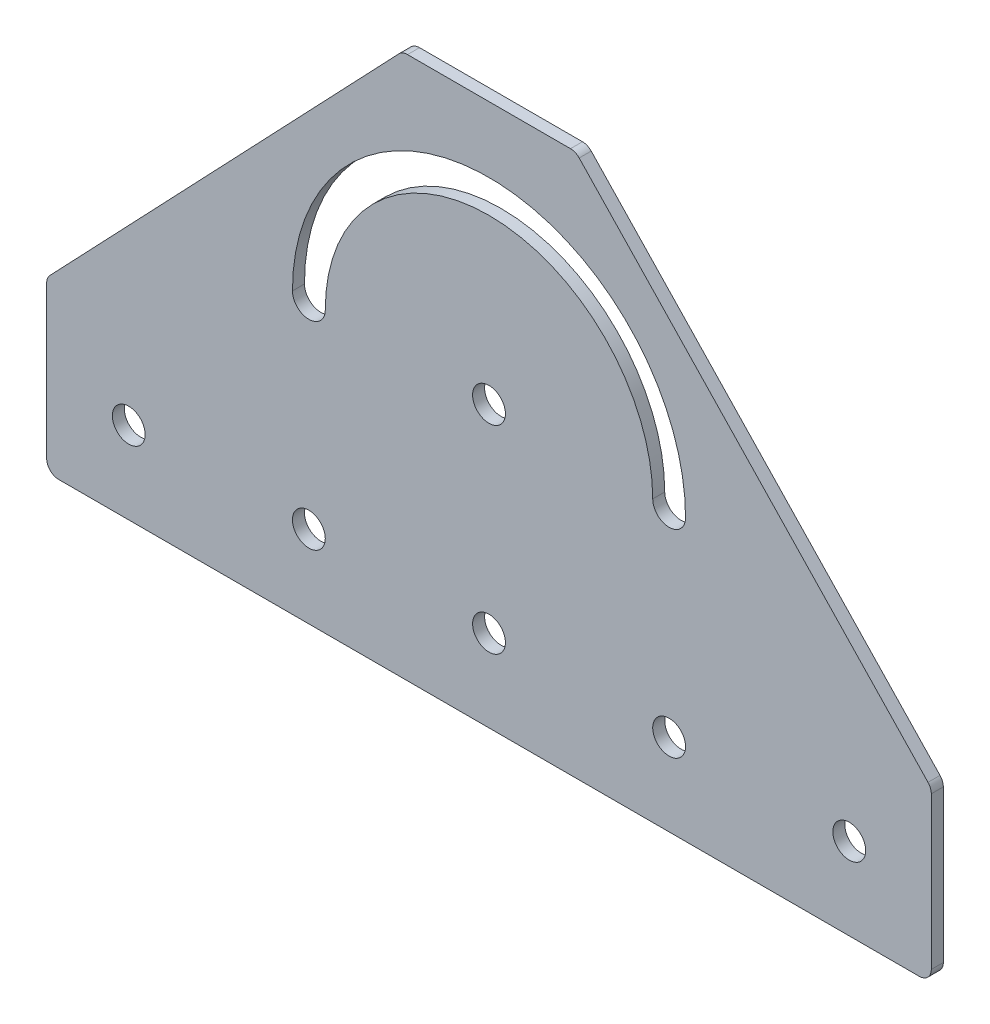
ISO-10303-21;
HEADER;
FILE_DESCRIPTION(('STEP AP214'),'2;1');
FILE_NAME('part.step','',(''),(''),'','','');
FILE_SCHEMA(('AUTOMOTIVE_DESIGN { 1 0 10303 214 1 1 1 1 }'));
ENDSEC;
DATA;
#1=APPLICATION_CONTEXT('core data for automotive mechanical design processes');
#2=APPLICATION_PROTOCOL_DEFINITION('international standard','automotive_design',2000,#1);
#3=PRODUCT_CONTEXT('',#1,'mechanical');
#4=PRODUCT('Part','Part','',(#3));
#5=PRODUCT_RELATED_PRODUCT_CATEGORY('part','',(#4));
#6=PRODUCT_DEFINITION_FORMATION('','',#4);
#7=PRODUCT_DEFINITION_CONTEXT('part definition',#1,'design');
#8=PRODUCT_DEFINITION('design','',#6,#7);
#9=PRODUCT_DEFINITION_SHAPE('','',#8);
#10=(LENGTH_UNIT() NAMED_UNIT(*) SI_UNIT(.MILLI.,.METRE.));
#11=(NAMED_UNIT(*) PLANE_ANGLE_UNIT() SI_UNIT($,.RADIAN.));
#12=(NAMED_UNIT(*) SI_UNIT($,.STERADIAN.) SOLID_ANGLE_UNIT());
#13=UNCERTAINTY_MEASURE_WITH_UNIT(LENGTH_MEASURE(1.E-05),#10,'distance_accuracy_value','');
#14=(GEOMETRIC_REPRESENTATION_CONTEXT(3) GLOBAL_UNCERTAINTY_ASSIGNED_CONTEXT((#13)) GLOBAL_UNIT_ASSIGNED_CONTEXT((#10,
#11,#12)) REPRESENTATION_CONTEXT('',''));
#15=CARTESIAN_POINT('',(0.,0.,0.));
#16=DIRECTION('',(0.,0.,1.));
#17=DIRECTION('',(1.,0.,0.));
#18=AXIS2_PLACEMENT_3D('',#15,#16,#17);
#19=CARTESIAN_POINT('',(0.,0.,3.));
#20=DIRECTION('',(0.,0.,1.));
#21=DIRECTION('',(1.,0.,0.));
#22=AXIS2_PLACEMENT_3D('',#19,#20,#21);
#23=PLANE('',#22);
#24=CARTESIAN_POINT('',(0.,71.9999999999994,3.));
#25=DIRECTION('',(0.,0.,1.));
#26=DIRECTION('',(1.,0.,0.));
#27=AXIS2_PLACEMENT_3D('',#24,#25,#26);
#28=CIRCLE('',#27,4.1);
#29=CARTESIAN_POINT('',(4.1,71.9999999999994,3.));
#30=VERTEX_POINT('',#29);
#31=EDGE_CURVE('E253',#30,#30,#28,.T.);
#32=ORIENTED_EDGE('',*,*,#31,.F.);
#33=EDGE_LOOP('',(#32));
#34=FACE_BOUND('',#33,.T.);
#35=CARTESIAN_POINT('',(-45.,22.4999999999991,3.));
#36=DIRECTION('',(0.,0.,1.));
#37=DIRECTION('',(1.,0.,0.));
#38=AXIS2_PLACEMENT_3D('',#35,#36,#37);
#39=CIRCLE('',#38,4.1);
#40=CARTESIAN_POINT('',(-40.9,22.4999999999991,3.));
#41=VERTEX_POINT('',#40);
#42=EDGE_CURVE('E267',#41,#41,#39,.T.);
#43=ORIENTED_EDGE('',*,*,#42,.F.);
#44=EDGE_LOOP('',(#43));
#45=FACE_BOUND('',#44,.T.);
#46=CARTESIAN_POINT('',(45.,22.4999999999997,3.));
#47=DIRECTION('',(0.,0.,1.));
#48=DIRECTION('',(1.,0.,0.));
#49=AXIS2_PLACEMENT_3D('',#46,#47,#48);
#50=CIRCLE('',#49,4.1);
#51=CARTESIAN_POINT('',(49.1,22.4999999999997,3.));
#52=VERTEX_POINT('',#51);
#53=EDGE_CURVE('E163',#52,#52,#50,.T.);
#54=ORIENTED_EDGE('',*,*,#53,.F.);
#55=EDGE_LOOP('',(#54));
#56=FACE_BOUND('',#55,.T.);
#57=CARTESIAN_POINT('',(90.,22.5,3.));
#58=DIRECTION('',(0.,0.,1.));
#59=DIRECTION('',(1.,0.,0.));
#60=AXIS2_PLACEMENT_3D('',#57,#58,#59);
#61=CIRCLE('',#60,4.1);
#62=CARTESIAN_POINT('',(94.1,22.5,3.));
#63=VERTEX_POINT('',#62);
#64=EDGE_CURVE('E174',#63,#63,#61,.T.);
#65=ORIENTED_EDGE('',*,*,#64,.F.);
#66=EDGE_LOOP('',(#65));
#67=FACE_BOUND('',#66,.T.);
#68=CARTESIAN_POINT('',(0.,71.9999999999994,3.));
#69=DIRECTION('',(0.,0.,1.));
#70=DIRECTION('',(1.,0.,0.));
#71=AXIS2_PLACEMENT_3D('',#68,#69,#70);
#72=CIRCLE('',#71,49.1);
#73=CARTESIAN_POINT('',(49.1,71.9999999999994,3.));
#74=VERTEX_POINT('',#73);
#75=CARTESIAN_POINT('',(-49.1,71.9999999999994,3.));
#76=VERTEX_POINT('',#75);
#77=EDGE_CURVE('E140',#74,#76,#72,.T.);
#78=ORIENTED_EDGE('',*,*,#77,.F.);
#79=CARTESIAN_POINT('',(45.,71.9999999999994,3.));
#80=DIRECTION('',(0.,0.,1.));
#81=DIRECTION('',(1.,0.,0.));
#82=AXIS2_PLACEMENT_3D('',#79,#80,#81);
#83=CIRCLE('',#82,4.1);
#84=CARTESIAN_POINT('',(40.9,71.9999999999994,3.));
#85=VERTEX_POINT('',#84);
#86=EDGE_CURVE('E130',#85,#74,#83,.T.);
#87=ORIENTED_EDGE('',*,*,#86,.F.);
#88=CARTESIAN_POINT('',(0.,71.9999999999994,3.));
#89=DIRECTION('',(0.,0.,-1.));
#90=DIRECTION('',(1.,0.,0.));
#91=AXIS2_PLACEMENT_3D('',#88,#89,#90);
#92=CIRCLE('',#91,40.9);
#93=CARTESIAN_POINT('',(-40.9,71.9999999999994,3.));
#94=VERTEX_POINT('',#93);
#95=EDGE_CURVE('E156',#94,#85,#92,.T.);
#96=ORIENTED_EDGE('',*,*,#95,.F.);
#97=CARTESIAN_POINT('',(-45.,71.9999999999994,3.));
#98=DIRECTION('',(0.,0.,1.));
#99=DIRECTION('',(1.,0.,0.));
#100=AXIS2_PLACEMENT_3D('',#97,#98,#99);
#101=CIRCLE('',#100,4.1);
#102=EDGE_CURVE('E154',#76,#94,#101,.T.);
#103=ORIENTED_EDGE('',*,*,#102,.F.);
#104=EDGE_LOOP('',(#78,#87,#96,#103));
#105=FACE_BOUND('',#104,.T.);
#106=CARTESIAN_POINT('',(0.,22.4999999999994,3.));
#107=DIRECTION('',(0.,0.,1.));
#108=DIRECTION('',(1.,0.,0.));
#109=AXIS2_PLACEMENT_3D('',#106,#107,#108);
#110=CIRCLE('',#109,4.1);
#111=CARTESIAN_POINT('',(4.1,22.4999999999994,3.));
#112=VERTEX_POINT('',#111);
#113=EDGE_CURVE('E273',#112,#112,#110,.T.);
#114=ORIENTED_EDGE('',*,*,#113,.F.);
#115=EDGE_LOOP('',(#114));
#116=FACE_BOUND('',#115,.T.);
#117=CARTESIAN_POINT('',(-90.,22.4999999999987,3.));
#118=DIRECTION('',(0.,0.,1.));
#119=DIRECTION('',(1.,0.,0.));
#120=AXIS2_PLACEMENT_3D('',#117,#118,#119);
#121=CIRCLE('',#120,4.1);
#122=CARTESIAN_POINT('',(-85.9,22.4999999999987,3.));
#123=VERTEX_POINT('',#122);
#124=EDGE_CURVE('E261',#123,#123,#121,.T.);
#125=ORIENTED_EDGE('',*,*,#124,.F.);
#126=EDGE_LOOP('',(#125));
#127=FACE_BOUND('',#126,.T.);
#128=DIRECTION('',(0.,1.,0.));
#129=VECTOR('',#128,1.);
#130=CARTESIAN_POINT('',(110.5,2.00000000000001,3.));
#131=LINE('',#130,#129);
#132=CARTESIAN_POINT('',(110.5,5.00000000000001,3.));
#133=VERTEX_POINT('',#132);
#134=CARTESIAN_POINT('',(110.5,43.,3.));
#135=VERTEX_POINT('',#134);
#136=EDGE_CURVE('E243',#133,#135,#131,.T.);
#137=ORIENTED_EDGE('',*,*,#136,.T.);
#138=CARTESIAN_POINT('',(107.5,43.,3.));
#139=DIRECTION('',(0.,0.,1.));
#140=DIRECTION('',(1.,0.,0.));
#141=AXIS2_PLACEMENT_3D('',#138,#139,#140);
#142=CIRCLE('',#141,3.);
#143=CARTESIAN_POINT('',(109.672413793103,45.0689655172414,3.));
#144=VERTEX_POINT('',#143);
#145=EDGE_CURVE('E194',#135,#144,#142,.T.);
#146=ORIENTED_EDGE('',*,*,#145,.T.);
#147=DIRECTION('',(-0.689655172413796,0.72413793103448,0.));
#148=VECTOR('',#147,1.);
#149=CARTESIAN_POINT('',(110.5,44.2,3.));
#150=LINE('',#149,#148);
#151=CARTESIAN_POINT('',(22.5295566502463,136.568965517241,3.));
#152=VERTEX_POINT('',#151);
#153=EDGE_CURVE('E239',#144,#152,#150,.T.);
#154=ORIENTED_EDGE('',*,*,#153,.T.);
#155=CARTESIAN_POINT('',(20.3571428571429,134.499999999999,3.));
#156=DIRECTION('',(0.,0.,1.));
#157=DIRECTION('',(1.,0.,0.));
#158=AXIS2_PLACEMENT_3D('',#155,#156,#157);
#159=CIRCLE('',#158,3.);
#160=CARTESIAN_POINT('',(20.3571428571429,137.499999999999,3.));
#161=VERTEX_POINT('',#160);
#162=EDGE_CURVE('E186',#152,#161,#159,.T.);
#163=ORIENTED_EDGE('',*,*,#162,.T.);
#164=DIRECTION('',(-1.,0.,0.));
#165=VECTOR('',#164,1.);
#166=CARTESIAN_POINT('',(21.6428571428571,137.499999999999,3.));
#167=LINE('',#166,#165);
#168=CARTESIAN_POINT('',(-20.3571428571429,137.499999999999,3.));
#169=VERTEX_POINT('',#168);
#170=EDGE_CURVE('E230',#161,#169,#167,.T.);
#171=ORIENTED_EDGE('',*,*,#170,.T.);
#172=CARTESIAN_POINT('',(-20.3571428571429,134.499999999999,3.));
#173=DIRECTION('',(0.,0.,1.));
#174=DIRECTION('',(1.,0.,0.));
#175=AXIS2_PLACEMENT_3D('',#172,#173,#174);
#176=CIRCLE('',#175,3.);
#177=CARTESIAN_POINT('',(-22.5295566502463,136.568965517241,3.));
#178=VERTEX_POINT('',#177);
#179=EDGE_CURVE('E184',#169,#178,#176,.T.);
#180=ORIENTED_EDGE('',*,*,#179,.T.);
#181=DIRECTION('',(-0.689655172413795,-0.72413793103448,0.));
#182=VECTOR('',#181,1.);
#183=CARTESIAN_POINT('',(-21.6428571428572,137.499999999999,3.));
#184=LINE('',#183,#182);
#185=CARTESIAN_POINT('',(-109.672413793103,45.0689655172414,3.));
#186=VERTEX_POINT('',#185);
#187=EDGE_CURVE('E238',#178,#186,#184,.T.);
#188=ORIENTED_EDGE('',*,*,#187,.T.);
#189=CARTESIAN_POINT('',(-107.5,43.,3.));
#190=DIRECTION('',(0.,0.,1.));
#191=DIRECTION('',(1.,0.,0.));
#192=AXIS2_PLACEMENT_3D('',#189,#190,#191);
#193=CIRCLE('',#192,3.);
#194=CARTESIAN_POINT('',(-110.5,43.,3.));
#195=VERTEX_POINT('',#194);
#196=EDGE_CURVE('E188',#186,#195,#193,.T.);
#197=ORIENTED_EDGE('',*,*,#196,.T.);
#198=DIRECTION('',(0.,-1.,0.));
#199=VECTOR('',#198,1.);
#200=CARTESIAN_POINT('',(-110.5,44.2,3.));
#201=LINE('',#200,#199);
#202=CARTESIAN_POINT('',(-110.5,5.,3.));
#203=VERTEX_POINT('',#202);
#204=EDGE_CURVE('E241',#195,#203,#201,.T.);
#205=ORIENTED_EDGE('',*,*,#204,.T.);
#206=CARTESIAN_POINT('',(-107.5,5.,3.));
#207=DIRECTION('',(0.,0.,1.));
#208=DIRECTION('',(1.,0.,0.));
#209=AXIS2_PLACEMENT_3D('',#206,#207,#208);
#210=CIRCLE('',#209,3.);
#211=CARTESIAN_POINT('',(-107.5,2.,3.));
#212=VERTEX_POINT('',#211);
#213=EDGE_CURVE('E190',#203,#212,#210,.T.);
#214=ORIENTED_EDGE('',*,*,#213,.T.);
#215=DIRECTION('',(1.,0.,0.));
#216=VECTOR('',#215,1.);
#217=CARTESIAN_POINT('',(-110.5,2.,3.));
#218=LINE('',#217,#216);
#219=CARTESIAN_POINT('',(107.5,2.00000000000001,3.));
#220=VERTEX_POINT('',#219);
#221=EDGE_CURVE('E249',#212,#220,#218,.T.);
#222=ORIENTED_EDGE('',*,*,#221,.T.);
#223=CARTESIAN_POINT('',(107.5,5.00000000000001,3.));
#224=DIRECTION('',(0.,0.,1.));
#225=DIRECTION('',(1.,0.,0.));
#226=AXIS2_PLACEMENT_3D('',#223,#224,#225);
#227=CIRCLE('',#226,3.);
#228=EDGE_CURVE('E192',#220,#133,#227,.T.);
#229=ORIENTED_EDGE('',*,*,#228,.T.);
#230=EDGE_LOOP('',(#137,#146,#154,#163,#171,#180,#188,#197,#205,#214,#222,#229));
#231=FACE_BOUND('',#230,.T.);
#232=ADVANCED_FACE('F16',(#34,#45,#56,#67,#105,#116,#127,#231),#23,.T.);
#233=CARTESIAN_POINT('',(0.,0.,0.));
#234=DIRECTION('',(0.,0.,1.));
#235=DIRECTION('',(1.,0.,0.));
#236=AXIS2_PLACEMENT_3D('',#233,#234,#235);
#237=PLANE('',#236);
#238=CARTESIAN_POINT('',(0.,71.9999999999994,0.));
#239=DIRECTION('',(0.,0.,1.));
#240=DIRECTION('',(1.,0.,0.));
#241=AXIS2_PLACEMENT_3D('',#238,#239,#240);
#242=CIRCLE('',#241,4.1);
#243=CARTESIAN_POINT('',(4.1,71.9999999999994,0.));
#244=VERTEX_POINT('',#243);
#245=EDGE_CURVE('E257',#244,#244,#242,.T.);
#246=ORIENTED_EDGE('',*,*,#245,.T.);
#247=EDGE_LOOP('',(#246));
#248=FACE_BOUND('',#247,.T.);
#249=CARTESIAN_POINT('',(-90.,22.4999999999987,0.));
#250=DIRECTION('',(0.,0.,1.));
#251=DIRECTION('',(1.,0.,0.));
#252=AXIS2_PLACEMENT_3D('',#249,#250,#251);
#253=CIRCLE('',#252,4.1);
#254=CARTESIAN_POINT('',(-85.9,22.4999999999987,0.));
#255=VERTEX_POINT('',#254);
#256=EDGE_CURVE('E256',#255,#255,#253,.T.);
#257=ORIENTED_EDGE('',*,*,#256,.T.);
#258=EDGE_LOOP('',(#257));
#259=FACE_BOUND('',#258,.T.);
#260=CARTESIAN_POINT('',(-45.,22.4999999999991,0.));
#261=DIRECTION('',(0.,0.,1.));
#262=DIRECTION('',(1.,0.,0.));
#263=AXIS2_PLACEMENT_3D('',#260,#261,#262);
#264=CIRCLE('',#263,4.1);
#265=CARTESIAN_POINT('',(-40.9,22.4999999999991,0.));
#266=VERTEX_POINT('',#265);
#267=EDGE_CURVE('E264',#266,#266,#264,.T.);
#268=ORIENTED_EDGE('',*,*,#267,.T.);
#269=EDGE_LOOP('',(#268));
#270=FACE_BOUND('',#269,.T.);
#271=CARTESIAN_POINT('',(0.,22.4999999999994,0.));
#272=DIRECTION('',(0.,0.,1.));
#273=DIRECTION('',(1.,0.,0.));
#274=AXIS2_PLACEMENT_3D('',#271,#272,#273);
#275=CIRCLE('',#274,4.1);
#276=CARTESIAN_POINT('',(4.1,22.4999999999994,0.));
#277=VERTEX_POINT('',#276);
#278=EDGE_CURVE('E270',#277,#277,#275,.T.);
#279=ORIENTED_EDGE('',*,*,#278,.T.);
#280=EDGE_LOOP('',(#279));
#281=FACE_BOUND('',#280,.T.);
#282=CARTESIAN_POINT('',(45.,22.4999999999997,0.));
#283=DIRECTION('',(0.,0.,1.));
#284=DIRECTION('',(1.,0.,0.));
#285=AXIS2_PLACEMENT_3D('',#282,#283,#284);
#286=CIRCLE('',#285,4.1);
#287=CARTESIAN_POINT('',(49.1,22.4999999999997,0.));
#288=VERTEX_POINT('',#287);
#289=EDGE_CURVE('E276',#288,#288,#286,.T.);
#290=ORIENTED_EDGE('',*,*,#289,.T.);
#291=EDGE_LOOP('',(#290));
#292=FACE_BOUND('',#291,.T.);
#293=CARTESIAN_POINT('',(45.,71.9999999999994,0.));
#294=DIRECTION('',(0.,0.,1.));
#295=DIRECTION('',(1.,0.,0.));
#296=AXIS2_PLACEMENT_3D('',#293,#294,#295);
#297=CIRCLE('',#296,4.1);
#298=CARTESIAN_POINT('',(40.9,71.9999999999994,0.));
#299=VERTEX_POINT('',#298);
#300=CARTESIAN_POINT('',(49.1,71.9999999999994,0.));
#301=VERTEX_POINT('',#300);
#302=EDGE_CURVE('E161',#299,#301,#297,.T.);
#303=ORIENTED_EDGE('',*,*,#302,.T.);
#304=CARTESIAN_POINT('',(0.,71.9999999999994,0.));
#305=DIRECTION('',(0.,0.,1.));
#306=DIRECTION('',(1.,0.,0.));
#307=AXIS2_PLACEMENT_3D('',#304,#305,#306);
#308=CIRCLE('',#307,49.1);
#309=CARTESIAN_POINT('',(-49.1,71.9999999999994,0.));
#310=VERTEX_POINT('',#309);
#311=EDGE_CURVE('E147',#301,#310,#308,.T.);
#312=ORIENTED_EDGE('',*,*,#311,.T.);
#313=CARTESIAN_POINT('',(-45.,71.9999999999994,0.));
#314=DIRECTION('',(0.,0.,1.));
#315=DIRECTION('',(1.,0.,0.));
#316=AXIS2_PLACEMENT_3D('',#313,#314,#315);
#317=CIRCLE('',#316,4.1);
#318=CARTESIAN_POINT('',(-40.9,71.9999999999994,0.));
#319=VERTEX_POINT('',#318);
#320=EDGE_CURVE('E165',#310,#319,#317,.T.);
#321=ORIENTED_EDGE('',*,*,#320,.T.);
#322=CARTESIAN_POINT('',(0.,71.9999999999994,0.));
#323=DIRECTION('',(0.,0.,-1.));
#324=DIRECTION('',(1.,0.,0.));
#325=AXIS2_PLACEMENT_3D('',#322,#323,#324);
#326=CIRCLE('',#325,40.9);
#327=EDGE_CURVE('E141',#319,#299,#326,.T.);
#328=ORIENTED_EDGE('',*,*,#327,.T.);
#329=EDGE_LOOP('',(#303,#312,#321,#328));
#330=FACE_BOUND('',#329,.T.);
#331=CARTESIAN_POINT('',(90.,22.5,0.));
#332=DIRECTION('',(0.,0.,1.));
#333=DIRECTION('',(1.,0.,0.));
#334=AXIS2_PLACEMENT_3D('',#331,#332,#333);
#335=CIRCLE('',#334,4.1);
#336=CARTESIAN_POINT('',(94.1,22.5,0.));
#337=VERTEX_POINT('',#336);
#338=EDGE_CURVE('E148',#337,#337,#335,.T.);
#339=ORIENTED_EDGE('',*,*,#338,.T.);
#340=EDGE_LOOP('',(#339));
#341=FACE_BOUND('',#340,.T.);
#342=DIRECTION('',(-0.689655172413796,0.72413793103448,0.));
#343=VECTOR('',#342,1.);
#344=CARTESIAN_POINT('',(110.5,44.2,0.));
#345=LINE('',#344,#343);
#346=CARTESIAN_POINT('',(109.672413793103,45.0689655172414,0.));
#347=VERTEX_POINT('',#346);
#348=CARTESIAN_POINT('',(22.5295566502463,136.568965517241,0.));
#349=VERTEX_POINT('',#348);
#350=EDGE_CURVE('E343',#347,#349,#345,.T.);
#351=ORIENTED_EDGE('',*,*,#350,.F.);
#352=CARTESIAN_POINT('',(107.5,43.,0.));
#353=DIRECTION('',(0.,0.,1.));
#354=DIRECTION('',(1.,0.,0.));
#355=AXIS2_PLACEMENT_3D('',#352,#353,#354);
#356=CIRCLE('',#355,3.);
#357=CARTESIAN_POINT('',(110.5,43.,0.));
#358=VERTEX_POINT('',#357);
#359=EDGE_CURVE('E210',#347,#358,#356,.F.);
#360=ORIENTED_EDGE('',*,*,#359,.T.);
#361=DIRECTION('',(0.,1.,0.));
#362=VECTOR('',#361,1.);
#363=CARTESIAN_POINT('',(110.5,2.00000000000001,0.));
#364=LINE('',#363,#362);
#365=CARTESIAN_POINT('',(110.5,5.00000000000001,0.));
#366=VERTEX_POINT('',#365);
#367=EDGE_CURVE('E252',#366,#358,#364,.T.);
#368=ORIENTED_EDGE('',*,*,#367,.F.);
#369=CARTESIAN_POINT('',(107.5,5.00000000000001,0.));
#370=DIRECTION('',(0.,0.,1.));
#371=DIRECTION('',(1.,0.,0.));
#372=AXIS2_PLACEMENT_3D('',#369,#370,#371);
#373=CIRCLE('',#372,3.);
#374=CARTESIAN_POINT('',(107.5,2.00000000000001,0.));
#375=VERTEX_POINT('',#374);
#376=EDGE_CURVE('E208',#366,#375,#373,.F.);
#377=ORIENTED_EDGE('',*,*,#376,.T.);
#378=DIRECTION('',(1.,0.,0.));
#379=VECTOR('',#378,1.);
#380=CARTESIAN_POINT('',(-110.5,2.,0.));
#381=LINE('',#380,#379);
#382=CARTESIAN_POINT('',(-107.5,2.,0.));
#383=VERTEX_POINT('',#382);
#384=EDGE_CURVE('E260',#383,#375,#381,.T.);
#385=ORIENTED_EDGE('',*,*,#384,.F.);
#386=CARTESIAN_POINT('',(-107.5,5.,0.));
#387=DIRECTION('',(0.,0.,1.));
#388=DIRECTION('',(1.,0.,0.));
#389=AXIS2_PLACEMENT_3D('',#386,#387,#388);
#390=CIRCLE('',#389,3.);
#391=CARTESIAN_POINT('',(-110.5,5.,0.));
#392=VERTEX_POINT('',#391);
#393=EDGE_CURVE('E206',#383,#392,#390,.F.);
#394=ORIENTED_EDGE('',*,*,#393,.T.);
#395=DIRECTION('',(0.,-1.,0.));
#396=VECTOR('',#395,1.);
#397=CARTESIAN_POINT('',(-110.5,44.2,0.));
#398=LINE('',#397,#396);
#399=CARTESIAN_POINT('',(-110.5,43.,0.));
#400=VERTEX_POINT('',#399);
#401=EDGE_CURVE('E356',#400,#392,#398,.T.);
#402=ORIENTED_EDGE('',*,*,#401,.F.);
#403=CARTESIAN_POINT('',(-107.5,43.,0.));
#404=DIRECTION('',(0.,0.,1.));
#405=DIRECTION('',(1.,0.,0.));
#406=AXIS2_PLACEMENT_3D('',#403,#404,#405);
#407=CIRCLE('',#406,3.);
#408=CARTESIAN_POINT('',(-109.672413793103,45.0689655172414,0.));
#409=VERTEX_POINT('',#408);
#410=EDGE_CURVE('E204',#400,#409,#407,.F.);
#411=ORIENTED_EDGE('',*,*,#410,.T.);
#412=DIRECTION('',(-0.689655172413795,-0.72413793103448,0.));
#413=VECTOR('',#412,1.);
#414=CARTESIAN_POINT('',(-21.6428571428572,137.499999999999,0.));
#415=LINE('',#414,#413);
#416=CARTESIAN_POINT('',(-22.5295566502463,136.568965517241,0.));
#417=VERTEX_POINT('',#416);
#418=EDGE_CURVE('E349',#417,#409,#415,.T.);
#419=ORIENTED_EDGE('',*,*,#418,.F.);
#420=CARTESIAN_POINT('',(-20.3571428571429,134.499999999999,0.));
#421=DIRECTION('',(0.,0.,1.));
#422=DIRECTION('',(1.,0.,0.));
#423=AXIS2_PLACEMENT_3D('',#420,#421,#422);
#424=CIRCLE('',#423,3.);
#425=CARTESIAN_POINT('',(-20.3571428571429,137.499999999999,0.));
#426=VERTEX_POINT('',#425);
#427=EDGE_CURVE('E31',#417,#426,#424,.F.);
#428=ORIENTED_EDGE('',*,*,#427,.T.);
#429=DIRECTION('',(-1.,0.,0.));
#430=VECTOR('',#429,1.);
#431=CARTESIAN_POINT('',(21.6428571428571,137.499999999999,0.));
#432=LINE('',#431,#430);
#433=CARTESIAN_POINT('',(20.3571428571429,137.499999999999,0.));
#434=VERTEX_POINT('',#433);
#435=EDGE_CURVE('E231',#434,#426,#432,.T.);
#436=ORIENTED_EDGE('',*,*,#435,.F.);
#437=CARTESIAN_POINT('',(20.3571428571429,134.499999999999,0.));
#438=DIRECTION('',(0.,0.,1.));
#439=DIRECTION('',(1.,0.,0.));
#440=AXIS2_PLACEMENT_3D('',#437,#438,#439);
#441=CIRCLE('',#440,3.);
#442=EDGE_CURVE('E202',#434,#349,#441,.F.);
#443=ORIENTED_EDGE('',*,*,#442,.T.);
#444=EDGE_LOOP('',(#351,#360,#368,#377,#385,#394,#402,#411,#419,#428,#436,#443));
#445=FACE_BOUND('',#444,.T.);
#446=ADVANCED_FACE('F283',(#248,#259,#270,#281,#292,#330,#341,#445),#237,.F.);
#447=CARTESIAN_POINT('',(90.,22.5,3.));
#448=DIRECTION('',(0.,0.,-1.));
#449=DIRECTION('',(-1.,0.,0.));
#450=AXIS2_PLACEMENT_3D('',#447,#448,#449);
#451=CYLINDRICAL_SURFACE('',#450,4.1);
#452=ORIENTED_EDGE('',*,*,#64,.T.);
#453=EDGE_LOOP('',(#452));
#454=FACE_BOUND('',#453,.T.);
#455=ORIENTED_EDGE('',*,*,#338,.F.);
#456=EDGE_LOOP('',(#455));
#457=FACE_BOUND('',#456,.T.);
#458=ADVANCED_FACE('F309',(#454,#457),#451,.F.);
#459=CARTESIAN_POINT('',(45.,71.9999999999994,3.));
#460=DIRECTION('',(0.,0.,-1.));
#461=DIRECTION('',(-1.,0.,0.));
#462=AXIS2_PLACEMENT_3D('',#459,#460,#461);
#463=CYLINDRICAL_SURFACE('',#462,4.1);
#464=ORIENTED_EDGE('',*,*,#302,.F.);
#465=DIRECTION('',(0.,0.,-1.));
#466=VECTOR('',#465,1.);
#467=CARTESIAN_POINT('',(40.9,71.9999999999994,3.));
#468=LINE('',#467,#466);
#469=EDGE_CURVE('E136',#85,#299,#468,.T.);
#470=ORIENTED_EDGE('',*,*,#469,.F.);
#471=ORIENTED_EDGE('',*,*,#86,.T.);
#472=DIRECTION('',(0.,0.,-1.));
#473=VECTOR('',#472,1.);
#474=CARTESIAN_POINT('',(49.1,71.9999999999994,3.));
#475=LINE('',#474,#473);
#476=EDGE_CURVE('E133',#74,#301,#475,.T.);
#477=ORIENTED_EDGE('',*,*,#476,.T.);
#478=EDGE_LOOP('',(#464,#470,#471,#477));
#479=FACE_BOUND('',#478,.T.);
#480=ADVANCED_FACE('F132',(#479),#463,.F.);
#481=CARTESIAN_POINT('',(0.,71.9999999999994,3.));
#482=DIRECTION('',(0.,0.,-1.));
#483=DIRECTION('',(-1.,0.,0.));
#484=AXIS2_PLACEMENT_3D('',#481,#482,#483);
#485=CYLINDRICAL_SURFACE('',#484,49.1);
#486=ORIENTED_EDGE('',*,*,#311,.F.);
#487=ORIENTED_EDGE('',*,*,#476,.F.);
#488=ORIENTED_EDGE('',*,*,#77,.T.);
#489=DIRECTION('',(0.,0.,-1.));
#490=VECTOR('',#489,1.);
#491=CARTESIAN_POINT('',(-49.1,71.9999999999994,3.));
#492=LINE('',#491,#490);
#493=EDGE_CURVE('E149',#76,#310,#492,.T.);
#494=ORIENTED_EDGE('',*,*,#493,.T.);
#495=EDGE_LOOP('',(#486,#487,#488,#494));
#496=FACE_BOUND('',#495,.T.);
#497=ADVANCED_FACE('F144',(#496),#485,.F.);
#498=CARTESIAN_POINT('',(-45.,71.9999999999994,3.));
#499=DIRECTION('',(0.,0.,-1.));
#500=DIRECTION('',(-1.,0.,0.));
#501=AXIS2_PLACEMENT_3D('',#498,#499,#500);
#502=CYLINDRICAL_SURFACE('',#501,4.1);
#503=ORIENTED_EDGE('',*,*,#320,.F.);
#504=ORIENTED_EDGE('',*,*,#493,.F.);
#505=ORIENTED_EDGE('',*,*,#102,.T.);
#506=DIRECTION('',(0.,0.,-1.));
#507=VECTOR('',#506,1.);
#508=CARTESIAN_POINT('',(-40.9,71.9999999999994,3.));
#509=LINE('',#508,#507);
#510=EDGE_CURVE('E171',#94,#319,#509,.T.);
#511=ORIENTED_EDGE('',*,*,#510,.T.);
#512=EDGE_LOOP('',(#503,#504,#505,#511));
#513=FACE_BOUND('',#512,.T.);
#514=ADVANCED_FACE('F300',(#513),#502,.F.);
#515=CARTESIAN_POINT('',(0.,71.9999999999994,3.));
#516=DIRECTION('',(0.,0.,-1.));
#517=DIRECTION('',(-1.,0.,0.));
#518=AXIS2_PLACEMENT_3D('',#515,#516,#517);
#519=CYLINDRICAL_SURFACE('',#518,40.9);
#520=ORIENTED_EDGE('',*,*,#327,.F.);
#521=ORIENTED_EDGE('',*,*,#510,.F.);
#522=ORIENTED_EDGE('',*,*,#95,.T.);
#523=ORIENTED_EDGE('',*,*,#469,.T.);
#524=EDGE_LOOP('',(#520,#521,#522,#523));
#525=FACE_BOUND('',#524,.T.);
#526=ADVANCED_FACE('F289',(#525),#519,.T.);
#527=CARTESIAN_POINT('',(45.,22.4999999999997,3.));
#528=DIRECTION('',(0.,0.,-1.));
#529=DIRECTION('',(-1.,0.,0.));
#530=AXIS2_PLACEMENT_3D('',#527,#528,#529);
#531=CYLINDRICAL_SURFACE('',#530,4.1);
#532=ORIENTED_EDGE('',*,*,#53,.T.);
#533=EDGE_LOOP('',(#532));
#534=FACE_BOUND('',#533,.T.);
#535=ORIENTED_EDGE('',*,*,#289,.F.);
#536=EDGE_LOOP('',(#535));
#537=FACE_BOUND('',#536,.T.);
#538=ADVANCED_FACE('F286',(#534,#537),#531,.F.);
#539=CARTESIAN_POINT('',(0.,22.4999999999994,3.));
#540=DIRECTION('',(0.,0.,-1.));
#541=DIRECTION('',(-1.,0.,0.));
#542=AXIS2_PLACEMENT_3D('',#539,#540,#541);
#543=CYLINDRICAL_SURFACE('',#542,4.1);
#544=ORIENTED_EDGE('',*,*,#113,.T.);
#545=EDGE_LOOP('',(#544));
#546=FACE_BOUND('',#545,.T.);
#547=ORIENTED_EDGE('',*,*,#278,.F.);
#548=EDGE_LOOP('',(#547));
#549=FACE_BOUND('',#548,.T.);
#550=ADVANCED_FACE('F288',(#546,#549),#543,.F.);
#551=CARTESIAN_POINT('',(-45.,22.4999999999991,3.));
#552=DIRECTION('',(0.,0.,-1.));
#553=DIRECTION('',(-1.,0.,0.));
#554=AXIS2_PLACEMENT_3D('',#551,#552,#553);
#555=CYLINDRICAL_SURFACE('',#554,4.1);
#556=ORIENTED_EDGE('',*,*,#42,.T.);
#557=EDGE_LOOP('',(#556));
#558=FACE_BOUND('',#557,.T.);
#559=ORIENTED_EDGE('',*,*,#267,.F.);
#560=EDGE_LOOP('',(#559));
#561=FACE_BOUND('',#560,.T.);
#562=ADVANCED_FACE('F297',(#558,#561),#555,.F.);
#563=CARTESIAN_POINT('',(-90.,22.4999999999987,3.));
#564=DIRECTION('',(0.,0.,-1.));
#565=DIRECTION('',(-1.,0.,0.));
#566=AXIS2_PLACEMENT_3D('',#563,#564,#565);
#567=CYLINDRICAL_SURFACE('',#566,4.1);
#568=ORIENTED_EDGE('',*,*,#124,.T.);
#569=EDGE_LOOP('',(#568));
#570=FACE_BOUND('',#569,.T.);
#571=ORIENTED_EDGE('',*,*,#256,.F.);
#572=EDGE_LOOP('',(#571));
#573=FACE_BOUND('',#572,.T.);
#574=ADVANCED_FACE('F402',(#570,#573),#567,.F.);
#575=CARTESIAN_POINT('',(0.,71.9999999999994,3.));
#576=DIRECTION('',(0.,0.,-1.));
#577=DIRECTION('',(-1.,0.,0.));
#578=AXIS2_PLACEMENT_3D('',#575,#576,#577);
#579=CYLINDRICAL_SURFACE('',#578,4.1);
#580=ORIENTED_EDGE('',*,*,#31,.T.);
#581=EDGE_LOOP('',(#580));
#582=FACE_BOUND('',#581,.T.);
#583=ORIENTED_EDGE('',*,*,#245,.F.);
#584=EDGE_LOOP('',(#583));
#585=FACE_BOUND('',#584,.T.);
#586=ADVANCED_FACE('F399',(#582,#585),#579,.F.);
#587=CARTESIAN_POINT('',(110.5,2.00000000000001,0.));
#588=DIRECTION('',(1.,0.,0.));
#589=DIRECTION('',(0.,0.,-1.));
#590=AXIS2_PLACEMENT_3D('',#587,#588,#589);
#591=PLANE('',#590);
#592=ORIENTED_EDGE('',*,*,#367,.T.);
#593=DIRECTION('',(0.,0.,1.));
#594=VECTOR('',#593,1.);
#595=CARTESIAN_POINT('',(110.5,43.,0.));
#596=LINE('',#595,#594);
#597=EDGE_CURVE('E181',#358,#135,#596,.T.);
#598=ORIENTED_EDGE('',*,*,#597,.T.);
#599=ORIENTED_EDGE('',*,*,#136,.F.);
#600=DIRECTION('',(0.,0.,1.));
#601=VECTOR('',#600,1.);
#602=CARTESIAN_POINT('',(110.5,5.00000000000001,0.));
#603=LINE('',#602,#601);
#604=EDGE_CURVE('E177',#133,#366,#603,.F.);
#605=ORIENTED_EDGE('',*,*,#604,.T.);
#606=EDGE_LOOP('',(#592,#598,#599,#605));
#607=FACE_BOUND('',#606,.T.);
#608=ADVANCED_FACE('F363',(#607),#591,.T.);
#609=CARTESIAN_POINT('',(-110.5,2.,0.));
#610=DIRECTION('',(0.,-1.,0.));
#611=DIRECTION('',(1.,0.,0.));
#612=AXIS2_PLACEMENT_3D('',#609,#610,#611);
#613=PLANE('',#612);
#614=ORIENTED_EDGE('',*,*,#384,.T.);
#615=DIRECTION('',(0.,0.,1.));
#616=VECTOR('',#615,1.);
#617=CARTESIAN_POINT('',(107.5,2.00000000000001,0.));
#618=LINE('',#617,#616);
#619=EDGE_CURVE('E214',#375,#220,#618,.T.);
#620=ORIENTED_EDGE('',*,*,#619,.T.);
#621=ORIENTED_EDGE('',*,*,#221,.F.);
#622=DIRECTION('',(0.,0.,1.));
#623=VECTOR('',#622,1.);
#624=CARTESIAN_POINT('',(-107.5,2.,0.));
#625=LINE('',#624,#623);
#626=EDGE_CURVE('E212',#212,#383,#625,.F.);
#627=ORIENTED_EDGE('',*,*,#626,.T.);
#628=EDGE_LOOP('',(#614,#620,#621,#627));
#629=FACE_BOUND('',#628,.T.);
#630=ADVANCED_FACE('F371',(#629),#613,.T.);
#631=CARTESIAN_POINT('',(-110.5,44.2,0.));
#632=DIRECTION('',(-1.,0.,0.));
#633=DIRECTION('',(0.,0.,1.));
#634=AXIS2_PLACEMENT_3D('',#631,#632,#633);
#635=PLANE('',#634);
#636=ORIENTED_EDGE('',*,*,#401,.T.);
#637=DIRECTION('',(0.,0.,1.));
#638=VECTOR('',#637,1.);
#639=CARTESIAN_POINT('',(-110.5,5.,0.));
#640=LINE('',#639,#638);
#641=EDGE_CURVE('E219',#392,#203,#640,.T.);
#642=ORIENTED_EDGE('',*,*,#641,.T.);
#643=ORIENTED_EDGE('',*,*,#204,.F.);
#644=DIRECTION('',(0.,0.,1.));
#645=VECTOR('',#644,1.);
#646=CARTESIAN_POINT('',(-110.5,43.,0.));
#647=LINE('',#646,#645);
#648=EDGE_CURVE('E217',#195,#400,#647,.F.);
#649=ORIENTED_EDGE('',*,*,#648,.T.);
#650=EDGE_LOOP('',(#636,#642,#643,#649));
#651=FACE_BOUND('',#650,.T.);
#652=ADVANCED_FACE('F378',(#651),#635,.T.);
#653=CARTESIAN_POINT('',(-21.6428571428572,137.499999999999,0.));
#654=DIRECTION('',(-0.72413793103448,0.689655172413795,0.));
#655=DIRECTION('',(-0.689655172413796,-0.724137931034481,0.));
#656=AXIS2_PLACEMENT_3D('',#653,#654,#655);
#657=PLANE('',#656);
#658=ORIENTED_EDGE('',*,*,#418,.T.);
#659=DIRECTION('',(0.,0.,1.));
#660=VECTOR('',#659,1.);
#661=CARTESIAN_POINT('',(-109.672413793103,45.0689655172414,0.));
#662=LINE('',#661,#660);
#663=EDGE_CURVE('E224',#409,#186,#662,.T.);
#664=ORIENTED_EDGE('',*,*,#663,.T.);
#665=ORIENTED_EDGE('',*,*,#187,.F.);
#666=DIRECTION('',(0.,0.,1.));
#667=VECTOR('',#666,1.);
#668=CARTESIAN_POINT('',(-22.5295566502463,136.568965517241,0.));
#669=LINE('',#668,#667);
#670=EDGE_CURVE('E222',#178,#417,#669,.F.);
#671=ORIENTED_EDGE('',*,*,#670,.T.);
#672=EDGE_LOOP('',(#658,#664,#665,#671));
#673=FACE_BOUND('',#672,.T.);
#674=ADVANCED_FACE('F383',(#673),#657,.T.);
#675=CARTESIAN_POINT('',(21.6428571428571,137.499999999999,0.));
#676=DIRECTION('',(0.,1.,0.));
#677=DIRECTION('',(0.,0.,1.));
#678=AXIS2_PLACEMENT_3D('',#675,#676,#677);
#679=PLANE('',#678);
#680=ORIENTED_EDGE('',*,*,#170,.F.);
#681=DIRECTION('',(0.,0.,1.));
#682=VECTOR('',#681,1.);
#683=CARTESIAN_POINT('',(20.3571428571429,137.499999999999,0.));
#684=LINE('',#683,#682);
#685=EDGE_CURVE('E10',#161,#434,#684,.F.);
#686=ORIENTED_EDGE('',*,*,#685,.T.);
#687=ORIENTED_EDGE('',*,*,#435,.T.);
#688=DIRECTION('',(0.,0.,1.));
#689=VECTOR('',#688,1.);
#690=CARTESIAN_POINT('',(-20.3571428571429,137.499999999999,0.));
#691=LINE('',#690,#689);
#692=EDGE_CURVE('E24',#426,#169,#691,.T.);
#693=ORIENTED_EDGE('',*,*,#692,.T.);
#694=EDGE_LOOP('',(#680,#686,#687,#693));
#695=FACE_BOUND('',#694,.T.);
#696=ADVANCED_FACE('F229',(#695),#679,.T.);
#697=CARTESIAN_POINT('',(110.5,44.2,0.));
#698=DIRECTION('',(0.72413793103448,0.689655172413796,0.));
#699=DIRECTION('',(-0.689655172413796,0.72413793103448,0.));
#700=AXIS2_PLACEMENT_3D('',#697,#698,#699);
#701=PLANE('',#700);
#702=ORIENTED_EDGE('',*,*,#153,.F.);
#703=DIRECTION('',(0.,0.,1.));
#704=VECTOR('',#703,1.);
#705=CARTESIAN_POINT('',(109.672413793103,45.0689655172414,0.));
#706=LINE('',#705,#704);
#707=EDGE_CURVE('E199',#144,#347,#706,.F.);
#708=ORIENTED_EDGE('',*,*,#707,.T.);
#709=ORIENTED_EDGE('',*,*,#350,.T.);
#710=DIRECTION('',(0.,0.,1.));
#711=VECTOR('',#710,1.);
#712=CARTESIAN_POINT('',(22.5295566502463,136.568965517241,0.));
#713=LINE('',#712,#711);
#714=EDGE_CURVE('E196',#349,#152,#713,.T.);
#715=ORIENTED_EDGE('',*,*,#714,.T.);
#716=EDGE_LOOP('',(#702,#708,#709,#715));
#717=FACE_BOUND('',#716,.T.);
#718=ADVANCED_FACE('F321',(#717),#701,.T.);
#719=CARTESIAN_POINT('',(107.5,43.,0.));
#720=DIRECTION('',(0.,0.,1.));
#721=DIRECTION('',(1.,0.,0.));
#722=AXIS2_PLACEMENT_3D('',#719,#720,#721);
#723=CYLINDRICAL_SURFACE('',#722,3.);
#724=ORIENTED_EDGE('',*,*,#359,.F.);
#725=ORIENTED_EDGE('',*,*,#707,.F.);
#726=ORIENTED_EDGE('',*,*,#145,.F.);
#727=ORIENTED_EDGE('',*,*,#597,.F.);
#728=EDGE_LOOP('',(#724,#725,#726,#727));
#729=FACE_BOUND('',#728,.T.);
#730=ADVANCED_FACE('F317',(#729),#723,.T.);
#731=CARTESIAN_POINT('',(107.5,5.00000000000001,0.));
#732=DIRECTION('',(0.,0.,1.));
#733=DIRECTION('',(1.,0.,0.));
#734=AXIS2_PLACEMENT_3D('',#731,#732,#733);
#735=CYLINDRICAL_SURFACE('',#734,3.);
#736=ORIENTED_EDGE('',*,*,#376,.F.);
#737=ORIENTED_EDGE('',*,*,#604,.F.);
#738=ORIENTED_EDGE('',*,*,#228,.F.);
#739=ORIENTED_EDGE('',*,*,#619,.F.);
#740=EDGE_LOOP('',(#736,#737,#738,#739));
#741=FACE_BOUND('',#740,.T.);
#742=ADVANCED_FACE('F320',(#741),#735,.T.);
#743=CARTESIAN_POINT('',(-107.5,5.,0.));
#744=DIRECTION('',(0.,0.,1.));
#745=DIRECTION('',(1.,0.,0.));
#746=AXIS2_PLACEMENT_3D('',#743,#744,#745);
#747=CYLINDRICAL_SURFACE('',#746,3.);
#748=ORIENTED_EDGE('',*,*,#393,.F.);
#749=ORIENTED_EDGE('',*,*,#626,.F.);
#750=ORIENTED_EDGE('',*,*,#213,.F.);
#751=ORIENTED_EDGE('',*,*,#641,.F.);
#752=EDGE_LOOP('',(#748,#749,#750,#751));
#753=FACE_BOUND('',#752,.T.);
#754=ADVANCED_FACE('F325',(#753),#747,.T.);
#755=CARTESIAN_POINT('',(-107.5,43.,0.));
#756=DIRECTION('',(0.,0.,1.));
#757=DIRECTION('',(1.,0.,0.));
#758=AXIS2_PLACEMENT_3D('',#755,#756,#757);
#759=CYLINDRICAL_SURFACE('',#758,3.);
#760=ORIENTED_EDGE('',*,*,#410,.F.);
#761=ORIENTED_EDGE('',*,*,#648,.F.);
#762=ORIENTED_EDGE('',*,*,#196,.F.);
#763=ORIENTED_EDGE('',*,*,#663,.F.);
#764=EDGE_LOOP('',(#760,#761,#762,#763));
#765=FACE_BOUND('',#764,.T.);
#766=ADVANCED_FACE('F329',(#765),#759,.T.);
#767=CARTESIAN_POINT('',(20.3571428571429,134.499999999999,0.));
#768=DIRECTION('',(0.,0.,1.));
#769=DIRECTION('',(1.,0.,0.));
#770=AXIS2_PLACEMENT_3D('',#767,#768,#769);
#771=CYLINDRICAL_SURFACE('',#770,3.);
#772=ORIENTED_EDGE('',*,*,#442,.F.);
#773=ORIENTED_EDGE('',*,*,#685,.F.);
#774=ORIENTED_EDGE('',*,*,#162,.F.);
#775=ORIENTED_EDGE('',*,*,#714,.F.);
#776=EDGE_LOOP('',(#772,#773,#774,#775));
#777=FACE_BOUND('',#776,.T.);
#778=ADVANCED_FACE('F332',(#777),#771,.T.);
#779=CARTESIAN_POINT('',(-20.3571428571429,134.499999999999,0.));
#780=DIRECTION('',(0.,0.,1.));
#781=DIRECTION('',(1.,0.,0.));
#782=AXIS2_PLACEMENT_3D('',#779,#780,#781);
#783=CYLINDRICAL_SURFACE('',#782,3.);
#784=ORIENTED_EDGE('',*,*,#427,.F.);
#785=ORIENTED_EDGE('',*,*,#670,.F.);
#786=ORIENTED_EDGE('',*,*,#179,.F.);
#787=ORIENTED_EDGE('',*,*,#692,.F.);
#788=EDGE_LOOP('',(#784,#785,#786,#787));
#789=FACE_BOUND('',#788,.T.);
#790=ADVANCED_FACE('F18',(#789),#783,.T.);
#791=CLOSED_SHELL('',(#232,#446,#458,#480,#497,#514,#526,#538,#550,#562,#574,#586,#608,#630,
#652,#674,#696,#718,#730,#742,#754,#766,#778,#790));
#792=MANIFOLD_SOLID_BREP('B1',#791);
#793=ADVANCED_BREP_SHAPE_REPRESENTATION('',(#18,#792),#14);
#794=SHAPE_DEFINITION_REPRESENTATION(#9,#793);
ENDSEC;
END-ISO-10303-21;
